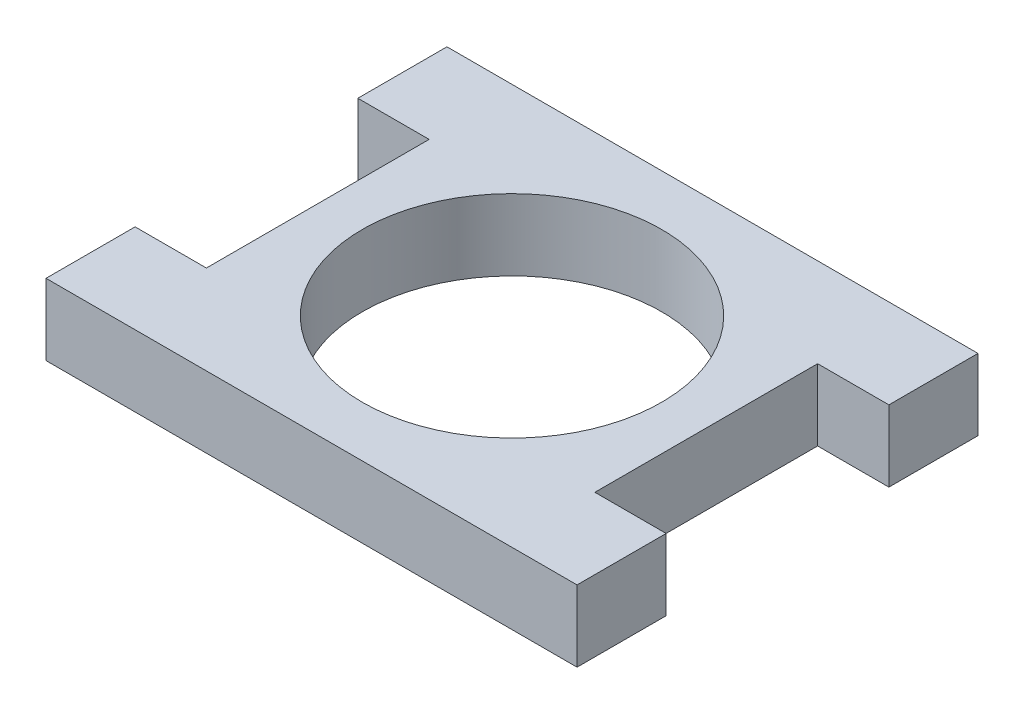
ISO-10303-21;
HEADER;
FILE_DESCRIPTION(('STEP AP214'),'2;1');
FILE_NAME('part.step','',(''),(''),'','','');
FILE_SCHEMA(('AUTOMOTIVE_DESIGN { 1 0 10303 214 1 1 1 1 }'));
ENDSEC;
DATA;
#1=APPLICATION_CONTEXT('core data for automotive mechanical design processes');
#2=APPLICATION_PROTOCOL_DEFINITION('international standard','automotive_design',2000,#1);
#3=PRODUCT_CONTEXT('',#1,'mechanical');
#4=PRODUCT('Part','Part','',(#3));
#5=PRODUCT_RELATED_PRODUCT_CATEGORY('part','',(#4));
#6=PRODUCT_DEFINITION_FORMATION('','',#4);
#7=PRODUCT_DEFINITION_CONTEXT('part definition',#1,'design');
#8=PRODUCT_DEFINITION('design','',#6,#7);
#9=PRODUCT_DEFINITION_SHAPE('','',#8);
#10=(LENGTH_UNIT() NAMED_UNIT(*) SI_UNIT(.MILLI.,.METRE.));
#11=(NAMED_UNIT(*) PLANE_ANGLE_UNIT() SI_UNIT($,.RADIAN.));
#12=(NAMED_UNIT(*) SI_UNIT($,.STERADIAN.) SOLID_ANGLE_UNIT());
#13=UNCERTAINTY_MEASURE_WITH_UNIT(LENGTH_MEASURE(1.E-05),#10,'distance_accuracy_value','');
#14=(GEOMETRIC_REPRESENTATION_CONTEXT(3) GLOBAL_UNCERTAINTY_ASSIGNED_CONTEXT((#13)) GLOBAL_UNIT_ASSIGNED_CONTEXT((#10,
#11,#12)) REPRESENTATION_CONTEXT('',''));
#15=CARTESIAN_POINT('',(0.,0.,0.));
#16=DIRECTION('',(0.,0.,1.));
#17=DIRECTION('',(1.,0.,0.));
#18=AXIS2_PLACEMENT_3D('',#15,#16,#17);
#19=CARTESIAN_POINT('',(-18.923,5.08,0.));
#20=DIRECTION('',(-1.,0.,0.));
#21=DIRECTION('',(0.,0.,1.));
#22=AXIS2_PLACEMENT_3D('',#19,#20,#21);
#23=PLANE('',#22);
#24=DIRECTION('',(0.,0.,-1.));
#25=VECTOR('',#24,1.);
#26=CARTESIAN_POINT('',(-18.923,0.,0.));
#27=LINE('',#26,#25);
#28=CARTESIAN_POINT('',(-18.923,0.,14.2875));
#29=VERTEX_POINT('',#28);
#30=CARTESIAN_POINT('',(-18.923,0.,7.9375));
#31=VERTEX_POINT('',#30);
#32=EDGE_CURVE('E155',#29,#31,#27,.T.);
#33=ORIENTED_EDGE('',*,*,#32,.F.);
#34=DIRECTION('',(0.,-1.,0.));
#35=VECTOR('',#34,1.);
#36=CARTESIAN_POINT('',(-18.923,5.08,14.2875));
#37=LINE('',#36,#35);
#38=CARTESIAN_POINT('',(-18.923,5.08,14.2875));
#39=VERTEX_POINT('',#38);
#40=EDGE_CURVE('E11',#39,#29,#37,.T.);
#41=ORIENTED_EDGE('',*,*,#40,.F.);
#42=DIRECTION('',(0.,0.,-1.));
#43=VECTOR('',#42,1.);
#44=CARTESIAN_POINT('',(-18.923,5.08,0.));
#45=LINE('',#44,#43);
#46=CARTESIAN_POINT('',(-18.923,5.08,7.9375));
#47=VERTEX_POINT('',#46);
#48=EDGE_CURVE('E189',#39,#47,#45,.T.);
#49=ORIENTED_EDGE('',*,*,#48,.T.);
#50=DIRECTION('',(0.,-1.,0.));
#51=VECTOR('',#50,1.);
#52=CARTESIAN_POINT('',(-18.923,5.08,7.9375));
#53=LINE('',#52,#51);
#54=EDGE_CURVE('E95',#47,#31,#53,.T.);
#55=ORIENTED_EDGE('',*,*,#54,.T.);
#56=EDGE_LOOP('',(#33,#41,#49,#55));
#57=FACE_BOUND('',#56,.T.);
#58=ADVANCED_FACE('F33',(#57),#23,.T.);
#59=CARTESIAN_POINT('',(0.,5.08,14.2875));
#60=DIRECTION('',(0.,0.,1.));
#61=DIRECTION('',(1.,0.,0.));
#62=AXIS2_PLACEMENT_3D('',#59,#60,#61);
#63=PLANE('',#62);
#64=DIRECTION('',(-1.,0.,0.));
#65=VECTOR('',#64,1.);
#66=CARTESIAN_POINT('',(0.,0.,14.2875));
#67=LINE('',#66,#65);
#68=CARTESIAN_POINT('',(18.923,0.,14.2875));
#69=VERTEX_POINT('',#68);
#70=EDGE_CURVE('E158',#69,#29,#67,.T.);
#71=ORIENTED_EDGE('',*,*,#70,.F.);
#72=DIRECTION('',(0.,-1.,0.));
#73=VECTOR('',#72,1.);
#74=CARTESIAN_POINT('',(18.923,5.08,14.2875));
#75=LINE('',#74,#73);
#76=CARTESIAN_POINT('',(18.923,5.08,14.2875));
#77=VERTEX_POINT('',#76);
#78=EDGE_CURVE('E41',#77,#69,#75,.T.);
#79=ORIENTED_EDGE('',*,*,#78,.F.);
#80=DIRECTION('',(-1.,0.,0.));
#81=VECTOR('',#80,1.);
#82=CARTESIAN_POINT('',(0.,5.08,14.2875));
#83=LINE('',#82,#81);
#84=EDGE_CURVE('E219',#77,#39,#83,.T.);
#85=ORIENTED_EDGE('',*,*,#84,.T.);
#86=ORIENTED_EDGE('',*,*,#40,.T.);
#87=EDGE_LOOP('',(#71,#79,#85,#86));
#88=FACE_BOUND('',#87,.T.);
#89=ADVANCED_FACE('F218',(#88),#63,.T.);
#90=CARTESIAN_POINT('',(18.923,5.08,0.));
#91=DIRECTION('',(-1.,0.,0.));
#92=DIRECTION('',(0.,0.,1.));
#93=AXIS2_PLACEMENT_3D('',#90,#91,#92);
#94=PLANE('',#93);
#95=DIRECTION('',(0.,0.,-1.));
#96=VECTOR('',#95,1.);
#97=CARTESIAN_POINT('',(18.923,0.,0.));
#98=LINE('',#97,#96);
#99=CARTESIAN_POINT('',(18.923,0.,7.93749999999999));
#100=VERTEX_POINT('',#99);
#101=EDGE_CURVE('E161',#69,#100,#98,.T.);
#102=ORIENTED_EDGE('',*,*,#101,.T.);
#103=DIRECTION('',(0.,-1.,0.));
#104=VECTOR('',#103,1.);
#105=CARTESIAN_POINT('',(18.923,5.08,7.93749999999999));
#106=LINE('',#105,#104);
#107=CARTESIAN_POINT('',(18.923,5.08,7.93749999999999));
#108=VERTEX_POINT('',#107);
#109=EDGE_CURVE('E203',#108,#100,#106,.T.);
#110=ORIENTED_EDGE('',*,*,#109,.F.);
#111=DIRECTION('',(0.,0.,-1.));
#112=VECTOR('',#111,1.);
#113=CARTESIAN_POINT('',(18.923,5.08,0.));
#114=LINE('',#113,#112);
#115=EDGE_CURVE('E209',#77,#108,#114,.T.);
#116=ORIENTED_EDGE('',*,*,#115,.F.);
#117=ORIENTED_EDGE('',*,*,#78,.T.);
#118=EDGE_LOOP('',(#102,#110,#116,#117));
#119=FACE_BOUND('',#118,.T.);
#120=ADVANCED_FACE('F207',(#119),#94,.F.);
#121=CARTESIAN_POINT('',(0.,5.08,7.93749999999999));
#122=DIRECTION('',(0.,0.,-1.));
#123=DIRECTION('',(-1.,0.,0.));
#124=AXIS2_PLACEMENT_3D('',#121,#122,#123);
#125=PLANE('',#124);
#126=DIRECTION('',(1.,0.,0.));
#127=VECTOR('',#126,1.);
#128=CARTESIAN_POINT('',(0.,0.,7.93749999999999));
#129=LINE('',#128,#127);
#130=CARTESIAN_POINT('',(13.843,0.,7.93749999999999));
#131=VERTEX_POINT('',#130);
#132=EDGE_CURVE('E164',#131,#100,#129,.T.);
#133=ORIENTED_EDGE('',*,*,#132,.F.);
#134=DIRECTION('',(0.,-1.,0.));
#135=VECTOR('',#134,1.);
#136=CARTESIAN_POINT('',(13.843,5.08,7.93749999999999));
#137=LINE('',#136,#135);
#138=CARTESIAN_POINT('',(13.843,5.08,7.93749999999999));
#139=VERTEX_POINT('',#138);
#140=EDGE_CURVE('E201',#139,#131,#137,.T.);
#141=ORIENTED_EDGE('',*,*,#140,.F.);
#142=DIRECTION('',(1.,0.,0.));
#143=VECTOR('',#142,1.);
#144=CARTESIAN_POINT('',(0.,5.08,7.93749999999999));
#145=LINE('',#144,#143);
#146=EDGE_CURVE('E227',#139,#108,#145,.T.);
#147=ORIENTED_EDGE('',*,*,#146,.T.);
#148=ORIENTED_EDGE('',*,*,#109,.T.);
#149=EDGE_LOOP('',(#133,#141,#147,#148));
#150=FACE_BOUND('',#149,.T.);
#151=ADVANCED_FACE('F267',(#150),#125,.T.);
#152=CARTESIAN_POINT('',(13.843,5.08,0.));
#153=DIRECTION('',(1.,0.,0.));
#154=DIRECTION('',(0.,0.,-1.));
#155=AXIS2_PLACEMENT_3D('',#152,#153,#154);
#156=PLANE('',#155);
#157=DIRECTION('',(0.,0.,1.));
#158=VECTOR('',#157,1.);
#159=CARTESIAN_POINT('',(13.843,0.,0.));
#160=LINE('',#159,#158);
#161=CARTESIAN_POINT('',(13.843,0.,-7.9375));
#162=VERTEX_POINT('',#161);
#163=EDGE_CURVE('E167',#162,#131,#160,.T.);
#164=ORIENTED_EDGE('',*,*,#163,.F.);
#165=DIRECTION('',(0.,-1.,0.));
#166=VECTOR('',#165,1.);
#167=CARTESIAN_POINT('',(13.843,5.08,-7.9375));
#168=LINE('',#167,#166);
#169=CARTESIAN_POINT('',(13.843,5.08,-7.9375));
#170=VERTEX_POINT('',#169);
#171=EDGE_CURVE('E199',#170,#162,#168,.T.);
#172=ORIENTED_EDGE('',*,*,#171,.F.);
#173=DIRECTION('',(0.,0.,1.));
#174=VECTOR('',#173,1.);
#175=CARTESIAN_POINT('',(13.843,5.08,0.));
#176=LINE('',#175,#174);
#177=EDGE_CURVE('E230',#170,#139,#176,.T.);
#178=ORIENTED_EDGE('',*,*,#177,.T.);
#179=ORIENTED_EDGE('',*,*,#140,.T.);
#180=EDGE_LOOP('',(#164,#172,#178,#179));
#181=FACE_BOUND('',#180,.T.);
#182=ADVANCED_FACE('F272',(#181),#156,.T.);
#183=CARTESIAN_POINT('',(0.,5.08,-7.93750000000001));
#184=DIRECTION('',(0.,0.,-1.));
#185=DIRECTION('',(-1.,0.,0.));
#186=AXIS2_PLACEMENT_3D('',#183,#184,#185);
#187=PLANE('',#186);
#188=DIRECTION('',(1.,0.,0.));
#189=VECTOR('',#188,1.);
#190=CARTESIAN_POINT('',(0.,0.,-7.93750000000001));
#191=LINE('',#190,#189);
#192=CARTESIAN_POINT('',(18.923,0.,-7.9375));
#193=VERTEX_POINT('',#192);
#194=EDGE_CURVE('E170',#162,#193,#191,.T.);
#195=ORIENTED_EDGE('',*,*,#194,.T.);
#196=DIRECTION('',(0.,-1.,0.));
#197=VECTOR('',#196,1.);
#198=CARTESIAN_POINT('',(18.923,5.08,-7.9375));
#199=LINE('',#198,#197);
#200=CARTESIAN_POINT('',(18.923,5.08,-7.9375));
#201=VERTEX_POINT('',#200);
#202=EDGE_CURVE('E197',#201,#193,#199,.T.);
#203=ORIENTED_EDGE('',*,*,#202,.F.);
#204=DIRECTION('',(1.,0.,0.));
#205=VECTOR('',#204,1.);
#206=CARTESIAN_POINT('',(0.,5.08,-7.93750000000001));
#207=LINE('',#206,#205);
#208=EDGE_CURVE('E233',#170,#201,#207,.T.);
#209=ORIENTED_EDGE('',*,*,#208,.F.);
#210=ORIENTED_EDGE('',*,*,#171,.T.);
#211=EDGE_LOOP('',(#195,#203,#209,#210));
#212=FACE_BOUND('',#211,.T.);
#213=ADVANCED_FACE('F276',(#212),#187,.F.);
#214=CARTESIAN_POINT('',(18.923,5.08,0.));
#215=DIRECTION('',(1.,0.,0.));
#216=DIRECTION('',(0.,0.,-1.));
#217=AXIS2_PLACEMENT_3D('',#214,#215,#216);
#218=PLANE('',#217);
#219=DIRECTION('',(0.,0.,1.));
#220=VECTOR('',#219,1.);
#221=CARTESIAN_POINT('',(18.923,0.,0.));
#222=LINE('',#221,#220);
#223=CARTESIAN_POINT('',(18.923,0.,-14.2875));
#224=VERTEX_POINT('',#223);
#225=EDGE_CURVE('E173',#224,#193,#222,.T.);
#226=ORIENTED_EDGE('',*,*,#225,.F.);
#227=DIRECTION('',(0.,-1.,0.));
#228=VECTOR('',#227,1.);
#229=CARTESIAN_POINT('',(18.923,5.08,-14.2875));
#230=LINE('',#229,#228);
#231=CARTESIAN_POINT('',(18.923,5.08,-14.2875));
#232=VERTEX_POINT('',#231);
#233=EDGE_CURVE('E195',#232,#224,#230,.T.);
#234=ORIENTED_EDGE('',*,*,#233,.F.);
#235=DIRECTION('',(0.,0.,1.));
#236=VECTOR('',#235,1.);
#237=CARTESIAN_POINT('',(18.923,5.08,0.));
#238=LINE('',#237,#236);
#239=EDGE_CURVE('E235',#232,#201,#238,.T.);
#240=ORIENTED_EDGE('',*,*,#239,.T.);
#241=ORIENTED_EDGE('',*,*,#202,.T.);
#242=EDGE_LOOP('',(#226,#234,#240,#241));
#243=FACE_BOUND('',#242,.T.);
#244=ADVANCED_FACE('F247',(#243),#218,.T.);
#245=CARTESIAN_POINT('',(0.,5.08,-14.2875));
#246=DIRECTION('',(0.,0.,-1.));
#247=DIRECTION('',(-1.,0.,0.));
#248=AXIS2_PLACEMENT_3D('',#245,#246,#247);
#249=PLANE('',#248);
#250=DIRECTION('',(1.,0.,0.));
#251=VECTOR('',#250,1.);
#252=CARTESIAN_POINT('',(0.,0.,-14.2875));
#253=LINE('',#252,#251);
#254=CARTESIAN_POINT('',(-18.923,0.,-14.2875));
#255=VERTEX_POINT('',#254);
#256=EDGE_CURVE('E176',#255,#224,#253,.T.);
#257=ORIENTED_EDGE('',*,*,#256,.F.);
#258=DIRECTION('',(0.,-1.,0.));
#259=VECTOR('',#258,1.);
#260=CARTESIAN_POINT('',(-18.923,5.08,-14.2875));
#261=LINE('',#260,#259);
#262=CARTESIAN_POINT('',(-18.923,5.08,-14.2875));
#263=VERTEX_POINT('',#262);
#264=EDGE_CURVE('E193',#263,#255,#261,.T.);
#265=ORIENTED_EDGE('',*,*,#264,.F.);
#266=DIRECTION('',(1.,0.,0.));
#267=VECTOR('',#266,1.);
#268=CARTESIAN_POINT('',(0.,5.08,-14.2875));
#269=LINE('',#268,#267);
#270=EDGE_CURVE('E147',#263,#232,#269,.T.);
#271=ORIENTED_EDGE('',*,*,#270,.T.);
#272=ORIENTED_EDGE('',*,*,#233,.T.);
#273=EDGE_LOOP('',(#257,#265,#271,#272));
#274=FACE_BOUND('',#273,.T.);
#275=ADVANCED_FACE('F240',(#274),#249,.T.);
#276=CARTESIAN_POINT('',(-18.923,5.08,0.));
#277=DIRECTION('',(1.,0.,0.));
#278=DIRECTION('',(0.,0.,-1.));
#279=AXIS2_PLACEMENT_3D('',#276,#277,#278);
#280=PLANE('',#279);
#281=DIRECTION('',(0.,0.,1.));
#282=VECTOR('',#281,1.);
#283=CARTESIAN_POINT('',(-18.923,0.,0.));
#284=LINE('',#283,#282);
#285=CARTESIAN_POINT('',(-18.923,0.,-7.9375));
#286=VERTEX_POINT('',#285);
#287=EDGE_CURVE('E179',#255,#286,#284,.T.);
#288=ORIENTED_EDGE('',*,*,#287,.T.);
#289=DIRECTION('',(0.,-1.,0.));
#290=VECTOR('',#289,1.);
#291=CARTESIAN_POINT('',(-18.923,5.08,-7.9375));
#292=LINE('',#291,#290);
#293=CARTESIAN_POINT('',(-18.923,5.08,-7.9375));
#294=VERTEX_POINT('',#293);
#295=EDGE_CURVE('E134',#294,#286,#292,.T.);
#296=ORIENTED_EDGE('',*,*,#295,.F.);
#297=DIRECTION('',(0.,0.,1.));
#298=VECTOR('',#297,1.);
#299=CARTESIAN_POINT('',(-18.923,5.08,0.));
#300=LINE('',#299,#298);
#301=EDGE_CURVE('E144',#263,#294,#300,.T.);
#302=ORIENTED_EDGE('',*,*,#301,.F.);
#303=ORIENTED_EDGE('',*,*,#264,.T.);
#304=EDGE_LOOP('',(#288,#296,#302,#303));
#305=FACE_BOUND('',#304,.T.);
#306=ADVANCED_FACE('F251',(#305),#280,.F.);
#307=CARTESIAN_POINT('',(0.,5.08,-7.9375));
#308=DIRECTION('',(0.,0.,1.));
#309=DIRECTION('',(1.,0.,0.));
#310=AXIS2_PLACEMENT_3D('',#307,#308,#309);
#311=PLANE('',#310);
#312=DIRECTION('',(-1.,0.,0.));
#313=VECTOR('',#312,1.);
#314=CARTESIAN_POINT('',(0.,0.,-7.9375));
#315=LINE('',#314,#313);
#316=CARTESIAN_POINT('',(-13.843,0.,-7.9375));
#317=VERTEX_POINT('',#316);
#318=EDGE_CURVE('E133',#317,#286,#315,.T.);
#319=ORIENTED_EDGE('',*,*,#318,.F.);
#320=DIRECTION('',(0.,-1.,0.));
#321=VECTOR('',#320,1.);
#322=CARTESIAN_POINT('',(-13.843,5.08,-7.9375));
#323=LINE('',#322,#321);
#324=CARTESIAN_POINT('',(-13.843,5.08,-7.9375));
#325=VERTEX_POINT('',#324);
#326=EDGE_CURVE('E127',#325,#317,#323,.T.);
#327=ORIENTED_EDGE('',*,*,#326,.F.);
#328=DIRECTION('',(-1.,0.,0.));
#329=VECTOR('',#328,1.);
#330=CARTESIAN_POINT('',(0.,5.08,-7.9375));
#331=LINE('',#330,#329);
#332=EDGE_CURVE('E131',#325,#294,#331,.T.);
#333=ORIENTED_EDGE('',*,*,#332,.T.);
#334=ORIENTED_EDGE('',*,*,#295,.T.);
#335=EDGE_LOOP('',(#319,#327,#333,#334));
#336=FACE_BOUND('',#335,.T.);
#337=ADVANCED_FACE('F129',(#336),#311,.T.);
#338=CARTESIAN_POINT('',(-13.843,5.08,0.));
#339=DIRECTION('',(1.,0.,0.));
#340=DIRECTION('',(0.,0.,-1.));
#341=AXIS2_PLACEMENT_3D('',#338,#339,#340);
#342=PLANE('',#341);
#343=DIRECTION('',(0.,0.,1.));
#344=VECTOR('',#343,1.);
#345=CARTESIAN_POINT('',(-13.843,0.,0.));
#346=LINE('',#345,#344);
#347=CARTESIAN_POINT('',(-13.843,0.,7.9375));
#348=VERTEX_POINT('',#347);
#349=EDGE_CURVE('E88',#317,#348,#346,.T.);
#350=ORIENTED_EDGE('',*,*,#349,.T.);
#351=DIRECTION('',(0.,-1.,0.));
#352=VECTOR('',#351,1.);
#353=CARTESIAN_POINT('',(-13.843,5.08,7.9375));
#354=LINE('',#353,#352);
#355=CARTESIAN_POINT('',(-13.843,5.08,7.9375));
#356=VERTEX_POINT('',#355);
#357=EDGE_CURVE('E135',#356,#348,#354,.T.);
#358=ORIENTED_EDGE('',*,*,#357,.F.);
#359=DIRECTION('',(0.,0.,1.));
#360=VECTOR('',#359,1.);
#361=CARTESIAN_POINT('',(-13.843,5.08,0.));
#362=LINE('',#361,#360);
#363=EDGE_CURVE('E137',#325,#356,#362,.T.);
#364=ORIENTED_EDGE('',*,*,#363,.F.);
#365=ORIENTED_EDGE('',*,*,#326,.T.);
#366=EDGE_LOOP('',(#350,#358,#364,#365));
#367=FACE_BOUND('',#366,.T.);
#368=ADVANCED_FACE('F138',(#367),#342,.F.);
#369=CARTESIAN_POINT('',(0.,5.08,7.9375));
#370=DIRECTION('',(0.,0.,1.));
#371=DIRECTION('',(1.,0.,0.));
#372=AXIS2_PLACEMENT_3D('',#369,#370,#371);
#373=PLANE('',#372);
#374=DIRECTION('',(-1.,0.,0.));
#375=VECTOR('',#374,1.);
#376=CARTESIAN_POINT('',(0.,0.,7.9375));
#377=LINE('',#376,#375);
#378=EDGE_CURVE('E184',#348,#31,#377,.T.);
#379=ORIENTED_EDGE('',*,*,#378,.T.);
#380=ORIENTED_EDGE('',*,*,#54,.F.);
#381=DIRECTION('',(-1.,0.,0.));
#382=VECTOR('',#381,1.);
#383=CARTESIAN_POINT('',(0.,5.08,7.9375));
#384=LINE('',#383,#382);
#385=EDGE_CURVE('E49',#356,#47,#384,.T.);
#386=ORIENTED_EDGE('',*,*,#385,.F.);
#387=ORIENTED_EDGE('',*,*,#357,.T.);
#388=EDGE_LOOP('',(#379,#380,#386,#387));
#389=FACE_BOUND('',#388,.T.);
#390=ADVANCED_FACE('F222',(#389),#373,.F.);
#391=CARTESIAN_POINT('',(0.,5.08,0.));
#392=DIRECTION('',(0.,-1.,0.));
#393=DIRECTION('',(0.,0.,-1.));
#394=AXIS2_PLACEMENT_3D('',#391,#392,#393);
#395=CYLINDRICAL_SURFACE('',#394,10.668);
#396=CARTESIAN_POINT('',(0.,5.08,0.));
#397=DIRECTION('',(0.,1.,0.));
#398=DIRECTION('',(0.,0.,1.));
#399=AXIS2_PLACEMENT_3D('',#396,#397,#398);
#400=CIRCLE('',#399,10.668);
#401=CARTESIAN_POINT('',(0.,5.08,10.668));
#402=VERTEX_POINT('',#401);
#403=EDGE_CURVE('E152',#402,#402,#400,.T.);
#404=ORIENTED_EDGE('',*,*,#403,.T.);
#405=EDGE_LOOP('',(#404));
#406=FACE_BOUND('',#405,.T.);
#407=CARTESIAN_POINT('',(0.,0.,0.));
#408=DIRECTION('',(0.,1.,0.));
#409=DIRECTION('',(0.,0.,1.));
#410=AXIS2_PLACEMENT_3D('',#407,#408,#409);
#411=CIRCLE('',#410,10.668);
#412=CARTESIAN_POINT('',(0.,0.,10.668));
#413=VERTEX_POINT('',#412);
#414=EDGE_CURVE('E186',#413,#413,#411,.T.);
#415=ORIENTED_EDGE('',*,*,#414,.F.);
#416=EDGE_LOOP('',(#415));
#417=FACE_BOUND('',#416,.T.);
#418=ADVANCED_FACE('F320',(#406,#417),#395,.F.);
#419=CARTESIAN_POINT('',(0.,5.08,0.));
#420=DIRECTION('',(0.,1.,0.));
#421=DIRECTION('',(0.,0.,1.));
#422=AXIS2_PLACEMENT_3D('',#419,#420,#421);
#423=PLANE('',#422);
#424=ORIENTED_EDGE('',*,*,#48,.F.);
#425=ORIENTED_EDGE('',*,*,#84,.F.);
#426=ORIENTED_EDGE('',*,*,#115,.T.);
#427=ORIENTED_EDGE('',*,*,#146,.F.);
#428=ORIENTED_EDGE('',*,*,#177,.F.);
#429=ORIENTED_EDGE('',*,*,#208,.T.);
#430=ORIENTED_EDGE('',*,*,#239,.F.);
#431=ORIENTED_EDGE('',*,*,#270,.F.);
#432=ORIENTED_EDGE('',*,*,#301,.T.);
#433=ORIENTED_EDGE('',*,*,#332,.F.);
#434=ORIENTED_EDGE('',*,*,#363,.T.);
#435=ORIENTED_EDGE('',*,*,#385,.T.);
#436=EDGE_LOOP('',(#424,#425,#426,#427,#428,#429,#430,#431,#432,#433,#434,#435));
#437=FACE_BOUND('',#436,.T.);
#438=ORIENTED_EDGE('',*,*,#403,.F.);
#439=EDGE_LOOP('',(#438));
#440=FACE_BOUND('',#439,.T.);
#441=ADVANCED_FACE('F140',(#437,#440),#423,.T.);
#442=CARTESIAN_POINT('',(0.,0.,0.));
#443=DIRECTION('',(0.,1.,0.));
#444=DIRECTION('',(0.,0.,1.));
#445=AXIS2_PLACEMENT_3D('',#442,#443,#444);
#446=PLANE('',#445);
#447=ORIENTED_EDGE('',*,*,#32,.T.);
#448=ORIENTED_EDGE('',*,*,#378,.F.);
#449=ORIENTED_EDGE('',*,*,#349,.F.);
#450=ORIENTED_EDGE('',*,*,#318,.T.);
#451=ORIENTED_EDGE('',*,*,#287,.F.);
#452=ORIENTED_EDGE('',*,*,#256,.T.);
#453=ORIENTED_EDGE('',*,*,#225,.T.);
#454=ORIENTED_EDGE('',*,*,#194,.F.);
#455=ORIENTED_EDGE('',*,*,#163,.T.);
#456=ORIENTED_EDGE('',*,*,#132,.T.);
#457=ORIENTED_EDGE('',*,*,#101,.F.);
#458=ORIENTED_EDGE('',*,*,#70,.T.);
#459=EDGE_LOOP('',(#447,#448,#449,#450,#451,#452,#453,#454,#455,#456,#457,#458));
#460=FACE_BOUND('',#459,.T.);
#461=ORIENTED_EDGE('',*,*,#414,.T.);
#462=EDGE_LOOP('',(#461));
#463=FACE_BOUND('',#462,.T.);
#464=ADVANCED_FACE('F215',(#460,#463),#446,.F.);
#465=CLOSED_SHELL('',(#58,#89,#120,#151,#182,#213,#244,#275,#306,#337,#368,#390,#418,#441,#464));
#466=MANIFOLD_SOLID_BREP('B2',#465);
#467=ADVANCED_BREP_SHAPE_REPRESENTATION('',(#18,#466),#14);
#468=SHAPE_DEFINITION_REPRESENTATION(#9,#467);
ENDSEC;
END-ISO-10303-21;
